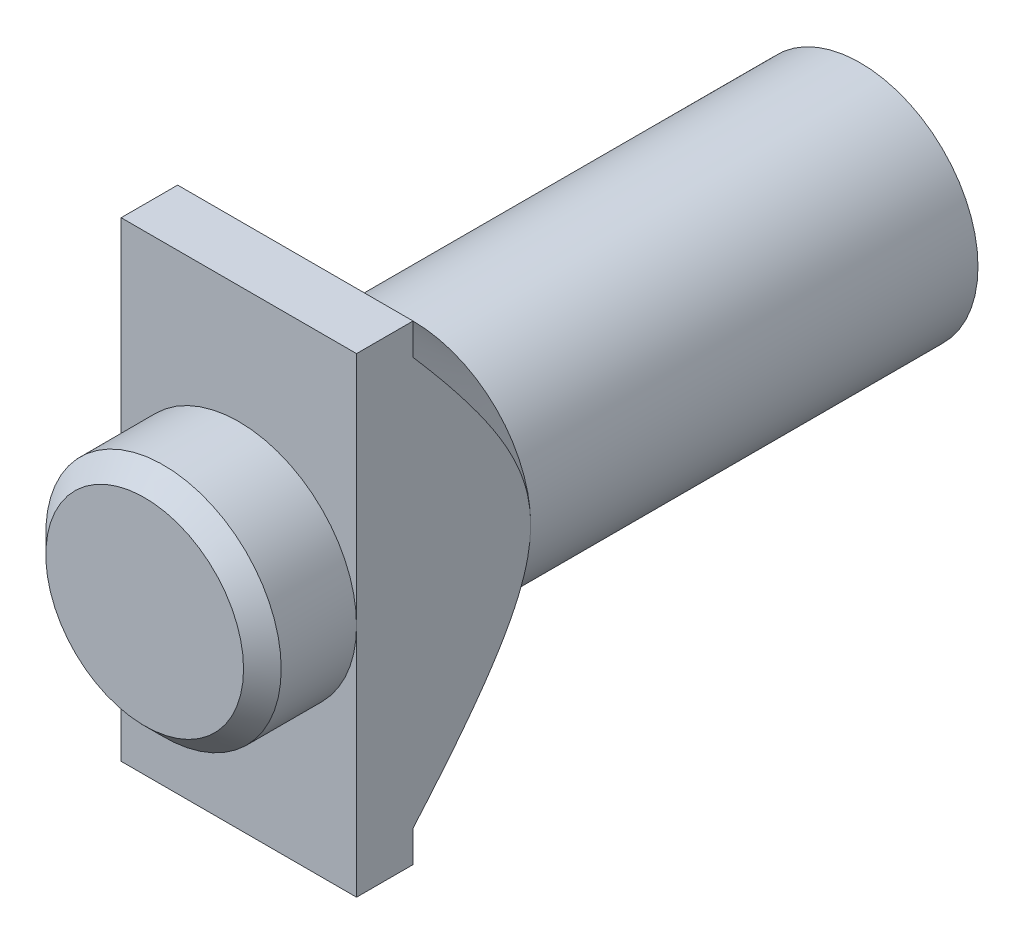
ISO-10303-21;
HEADER;
FILE_DESCRIPTION(('STEP AP214'),'2;1');
FILE_NAME('part.step','',(''),(''),'','','');
FILE_SCHEMA(('AUTOMOTIVE_DESIGN { 1 0 10303 214 1 1 1 1 }'));
ENDSEC;
DATA;
#1=APPLICATION_CONTEXT('core data for automotive mechanical design processes');
#2=APPLICATION_PROTOCOL_DEFINITION('international standard','automotive_design',2000,#1);
#3=PRODUCT_CONTEXT('',#1,'mechanical');
#4=PRODUCT('Part','Part','',(#3));
#5=PRODUCT_RELATED_PRODUCT_CATEGORY('part','',(#4));
#6=PRODUCT_DEFINITION_FORMATION('','',#4);
#7=PRODUCT_DEFINITION_CONTEXT('part definition',#1,'design');
#8=PRODUCT_DEFINITION('design','',#6,#7);
#9=PRODUCT_DEFINITION_SHAPE('','',#8);
#10=(LENGTH_UNIT() NAMED_UNIT(*) SI_UNIT(.MILLI.,.METRE.));
#11=(NAMED_UNIT(*) PLANE_ANGLE_UNIT() SI_UNIT($,.RADIAN.));
#12=(NAMED_UNIT(*) SI_UNIT($,.STERADIAN.) SOLID_ANGLE_UNIT());
#13=UNCERTAINTY_MEASURE_WITH_UNIT(LENGTH_MEASURE(1.E-05),#10,'distance_accuracy_value','');
#14=(GEOMETRIC_REPRESENTATION_CONTEXT(3) GLOBAL_UNCERTAINTY_ASSIGNED_CONTEXT((#13)) GLOBAL_UNIT_ASSIGNED_CONTEXT((#10,
#11,#12)) REPRESENTATION_CONTEXT('',''));
#15=CARTESIAN_POINT('',(0.,0.,0.));
#16=DIRECTION('',(0.,0.,1.));
#17=DIRECTION('',(1.,0.,0.));
#18=AXIS2_PLACEMENT_3D('',#15,#16,#17);
#19=CARTESIAN_POINT('',(0.,0.,33.));
#20=DIRECTION('',(0.,0.,-1.));
#21=DIRECTION('',(-1.,0.,0.));
#22=AXIS2_PLACEMENT_3D('',#19,#20,#21);
#23=PLANE('',#22);
#24=CARTESIAN_POINT('',(0.,0.,33.));
#25=DIRECTION('',(0.,0.,1.));
#26=DIRECTION('',(1.,0.,0.));
#27=AXIS2_PLACEMENT_3D('',#24,#25,#26);
#28=CIRCLE('',#27,6.25);
#29=CARTESIAN_POINT('',(6.25,0.,33.));
#30=VERTEX_POINT('',#29);
#31=CARTESIAN_POINT('',(-6.25,0.,33.));
#32=VERTEX_POINT('',#31);
#33=EDGE_CURVE('E136',#30,#32,#28,.T.);
#34=ORIENTED_EDGE('',*,*,#33,.F.);
#35=DIRECTION('',(0.,1.,0.));
#36=VECTOR('',#35,1.);
#37=CARTESIAN_POINT('',(6.25,12.5,33.));
#38=LINE('',#37,#36);
#39=CARTESIAN_POINT('',(6.25,12.5,33.));
#40=VERTEX_POINT('',#39);
#41=EDGE_CURVE('E124',#30,#40,#38,.T.);
#42=ORIENTED_EDGE('',*,*,#41,.T.);
#43=DIRECTION('',(-1.,0.,0.));
#44=VECTOR('',#43,1.);
#45=CARTESIAN_POINT('',(6.25,12.5,33.));
#46=LINE('',#45,#44);
#47=CARTESIAN_POINT('',(-6.25,12.5,33.));
#48=VERTEX_POINT('',#47);
#49=EDGE_CURVE('E123',#40,#48,#46,.T.);
#50=ORIENTED_EDGE('',*,*,#49,.T.);
#51=DIRECTION('',(0.,-1.,0.));
#52=VECTOR('',#51,1.);
#53=CARTESIAN_POINT('',(-6.25,12.5,33.));
#54=LINE('',#53,#52);
#55=EDGE_CURVE('E138',#48,#32,#54,.T.);
#56=ORIENTED_EDGE('',*,*,#55,.T.);
#57=EDGE_LOOP('',(#34,#42,#50,#56));
#58=FACE_BOUND('',#57,.T.);
#59=ADVANCED_FACE('F34',(#58),#23,.F.);
#60=CARTESIAN_POINT('',(0.,0.,17.5));
#61=DIRECTION('',(0.,0.,1.));
#62=DIRECTION('',(1.,0.,0.));
#63=AXIS2_PLACEMENT_3D('',#60,#61,#62);
#64=CONICAL_SURFACE('',#63,0.,0.785398163397448);
#65=CARTESIAN_POINT('',(-6.25,-20.3779042036245,38.8148183133729));
#66=CARTESIAN_POINT('',(-6.25,-19.956191433902,38.4116642934186));
#67=CARTESIAN_POINT('',(-6.25,-19.5339612836575,38.009049625188));
#68=CARTESIAN_POINT('',(-6.25,-18.6882032119992,37.2051749566873));
#69=CARTESIAN_POINT('',(-6.25,-18.2646752737749,36.8039149741074));
#70=CARTESIAN_POINT('',(-6.25,-17.4158750988892,36.0028526070599));
#71=CARTESIAN_POINT('',(-6.25,-16.9906021517175,35.6030509749646));
#72=CARTESIAN_POINT('',(-6.25,-16.1381531535375,34.8054851155684));
#73=CARTESIAN_POINT('',(-6.25,-15.7109771130856,34.4077208769922));
#74=CARTESIAN_POINT('',(-6.25,-14.8583547265776,33.6185421117259));
#75=CARTESIAN_POINT('',(-6.25,-14.4329309299977,33.2271032435303));
#76=CARTESIAN_POINT('',(-6.25,-13.5791568381813,32.4474311641986));
#77=CARTESIAN_POINT('',(-6.25,-13.1508065614255,32.059197932853));
#78=CARTESIAN_POINT('',(-6.25,-12.2904238158171,31.2869870505959));
#79=CARTESIAN_POINT('',(-6.25,-11.8583920366553,30.9030086323027));
#80=CARTESIAN_POINT('',(-6.25,-10.989419200207,30.1406562079682));
#81=CARTESIAN_POINT('',(-6.25,-10.5524783025272,29.7622820206425));
#82=CARTESIAN_POINT('',(-6.25,-9.80424107848541,29.1258131888779));
#83=CARTESIAN_POINT('',(-6.25,-9.49463466915096,28.8657341904933));
#84=CARTESIAN_POINT('',(-6.25,-8.87134141818233,28.3504553480673));
#85=CARTESIAN_POINT('',(-6.25,-8.55765431189853,28.0952558231571));
#86=CARTESIAN_POINT('',(-6.25,-7.92315769066826,27.5896943243694));
#87=CARTESIAN_POINT('',(-6.25,-7.60231577287842,27.3393729100103));
#88=CARTESIAN_POINT('',(-6.25,-6.95399389299023,26.8475015389668));
#89=CARTESIAN_POINT('',(-6.25,-6.62651488164475,26.6059503396093));
#90=CARTESIAN_POINT('',(-6.25,-6.12693213321716,26.2514528224235));
#91=CARTESIAN_POINT('',(-6.25,-5.95805177942696,26.1339635220813));
#92=CARTESIAN_POINT('',(-6.25,-5.61774717271675,25.902735729327));
#93=CARTESIAN_POINT('',(-6.25,-5.44632304676741,25.7889970506122));
#94=CARTESIAN_POINT('',(-6.25,-5.10039890316192,25.5659209828393));
#95=CARTESIAN_POINT('',(-6.25,-4.92589618113803,25.4565877720605));
#96=CARTESIAN_POINT('',(-6.25,-4.57356822916663,25.2434066254721));
#97=CARTESIAN_POINT('',(-6.25,-4.39574306799838,25.1395585762817));
#98=CARTESIAN_POINT('',(-6.25,-4.03752543568063,24.9392350286463));
#99=CARTESIAN_POINT('',(-6.25,-3.85715846158145,24.8427144183373));
#100=CARTESIAN_POINT('',(-6.25,-3.49232520144321,24.6577997142373));
#101=CARTESIAN_POINT('',(-6.25,-3.30785843761678,24.5694065738494));
#102=CARTESIAN_POINT('',(-6.25,-2.74828086539234,24.3194060826822));
#103=CARTESIAN_POINT('',(-6.25,-2.36614798790808,24.1724864812357));
#104=CARTESIAN_POINT('',(-6.25,-1.77377304479165,23.9939927652976));
#105=CARTESIAN_POINT('',(-6.25,-1.56994257847604,23.9410204441361));
#106=CARTESIAN_POINT('',(-6.25,-1.1583459974185,23.8532579073313));
#107=CARTESIAN_POINT('',(-6.25,-0.95058050667565,23.818464833507));
#108=CARTESIAN_POINT('',(-6.25,-0.533567581615178,23.7693345892413));
#109=CARTESIAN_POINT('',(-6.25,-0.324331248563969,23.7549047237935));
#110=CARTESIAN_POINT('',(-6.25,0.094539769901834,23.7472072627269));
#111=CARTESIAN_POINT('',(-6.25,0.304174453803751,23.7539395869078));
#112=CARTESIAN_POINT('',(-6.25,0.721043041717737,23.7880327727173));
#113=CARTESIAN_POINT('',(-6.25,0.928282509871575,23.8153269986723));
#114=CARTESIAN_POINT('',(-6.25,1.33937761500408,23.888699230379));
#115=CARTESIAN_POINT('',(-6.25,1.54323277334587,23.9347798698997));
#116=CARTESIAN_POINT('',(-6.25,1.94771992610081,24.0435385446616));
#117=CARTESIAN_POINT('',(-6.25,2.14832505757752,24.1063150287326));
#118=CARTESIAN_POINT('',(-6.25,2.54463187644215,24.2456078573584));
#119=CARTESIAN_POINT('',(-6.25,2.74033373350042,24.3221237257324));
#120=CARTESIAN_POINT('',(-6.25,3.20065245694356,24.5177034249675));
#121=CARTESIAN_POINT('',(-6.25,3.46309130630112,24.6418657274016));
#122=CARTESIAN_POINT('',(-6.25,3.97983098835652,24.9062301015164));
#123=CARTESIAN_POINT('',(-6.25,4.23412647018221,25.0464424534619));
#124=CARTESIAN_POINT('',(-6.25,4.73623797846259,25.3391819482185));
#125=CARTESIAN_POINT('',(-6.25,4.98403813791151,25.4917360908023));
#126=CARTESIAN_POINT('',(-6.25,5.47368749083448,25.8059332305952));
#127=CARTESIAN_POINT('',(-6.25,5.71553799493993,25.9675741998486));
#128=CARTESIAN_POINT('',(-6.25,6.19745467687006,26.3000078500455));
#129=CARTESIAN_POINT('',(-6.25,6.43745775048509,26.4708915899795));
#130=CARTESIAN_POINT('',(-6.25,6.91335330544523,26.8182897980414));
#131=CARTESIAN_POINT('',(-6.25,7.14924560963853,26.9948045079101));
#132=CARTESIAN_POINT('',(-6.25,7.61727805416882,27.3520355711754));
#133=CARTESIAN_POINT('',(-6.25,7.8494231388434,27.5327454615836));
#134=CARTESIAN_POINT('',(-6.25,8.19550409111854,27.8064942542065));
#135=CARTESIAN_POINT('',(-6.25,8.31050668431183,27.8981898617577));
#136=CARTESIAN_POINT('',(-6.25,8.53985964049112,28.082392715467));
#137=CARTESIAN_POINT('',(-6.25,8.65421000514089,28.1748999595533));
#138=CARTESIAN_POINT('',(-6.25,9.04920975406273,28.4965472759183));
#139=CARTESIAN_POINT('',(-6.25,9.32835133491879,28.7275406828485));
#140=CARTESIAN_POINT('',(-6.25,9.88369749073528,29.1930356641751));
#141=CARTESIAN_POINT('',(-6.25,10.1599019892755,29.4275373294732));
#142=CARTESIAN_POINT('',(-6.25,10.709910737363,29.8993836274437));
#143=CARTESIAN_POINT('',(-6.25,10.9837147785209,30.1367285027913));
#144=CARTESIAN_POINT('',(-6.25,11.5293044836752,30.6137285086972));
#145=CARTESIAN_POINT('',(-6.25,11.8010901301241,30.853383659299));
#146=CARTESIAN_POINT('',(-6.25,12.6140800724638,31.5753367494932));
#147=CARTESIAN_POINT('',(-6.25,13.1527552357815,32.0604823590886));
#148=CARTESIAN_POINT('',(-6.25,14.2252483019851,33.0361134236179));
#149=CARTESIAN_POINT('',(-6.25,14.7590661265787,33.5265989643439));
#150=CARTESIAN_POINT('',(-6.25,15.5575076805858,34.2656928953683));
#151=CARTESIAN_POINT('',(-6.25,15.8234972101369,34.5128281834132));
#152=CARTESIAN_POINT('',(-6.25,16.3546722789463,35.0079567391255));
#153=CARTESIAN_POINT('',(-6.25,16.6198578250411,35.2559499994588));
#154=CARTESIAN_POINT('',(-6.25,17.4143735193573,36.0010544618421));
#155=CARTESIAN_POINT('',(-6.25,17.9426553794712,36.4992835351428));
#156=CARTESIAN_POINT('',(-6.25,18.9969371386686,37.497940665872));
#157=CARTESIAN_POINT('',(-6.25,19.5229374660875,37.9983682715837));
#158=CARTESIAN_POINT('',(-6.25,20.5732023165024,39.0010415512331));
#159=CARTESIAN_POINT('',(-6.25,21.09746683838,39.5032872263419));
#160=CARTESIAN_POINT('',(-6.25,22.5515859782985,40.9002010455956));
#161=CARTESIAN_POINT('',(-6.25,23.4799367020753,41.796434344247));
#162=CARTESIAN_POINT('',(-6.25,25.3335870803069,43.5921566665612));
#163=CARTESIAN_POINT('',(-6.25,26.2588865508424,44.4916458798643));
#164=CARTESIAN_POINT('',(-6.25,28.1047594601269,46.290573585135));
#165=CARTESIAN_POINT('',(-6.25,29.025338925008,47.1900058965324));
#166=CARTESIAN_POINT('',(-6.25,30.8646926511388,48.9905946398053));
#167=CARTESIAN_POINT('',(-6.25,31.7834670264829,49.8917509551076));
#168=CARTESIAN_POINT('',(-6.25000000000001,32.7016290359367,50.7935285243847));
#169=B_SPLINE_CURVE_WITH_KNOTS('',3,(#65,#66,#67,#68,#69,#70,#71,#72,#73,#74,#75,#76,#77,#78,
#79,#80,#81,#82,#83,#84,#85,#86,#87,#88,#89,#90,#91,#92,#93,#94,#95,#96,#97,#98,#99,#100,#101,
#102,#103,#104,#105,#106,#107,#108,#109,#110,#111,#112,#113,#114,#115,#116,#117,#118,#119,#120,
#121,#122,#123,#124,#125,#126,#127,#128,#129,#130,#131,#132,#133,#134,#135,#136,#137,#138,#139,
#140,#141,#142,#143,#144,#145,#146,#147,#148,#149,#150,#151,#152,#153,#154,#155,#156,#157,#158,
#159,#160,#161,#162,#163,#164,#165,#166,#167,#168),.UNSPECIFIED.,.F.,.F.,(4,2,2,2,2,2,2,2,2,2,2,
2,2,2,2,2,2,2,2,2,2,2,2,2,2,2,2,2,2,2,2,2,2,2,2,2,2,2,2,2,2,2,2,2,2,2,2,2,2,2,2,4),(0.,
1.75025095945234,3.50052468690949,5.25160063652178,7.00266688486185,8.73698092366364,
10.4712840203936,12.2052690599496,13.9391978858885,15.1522047133163,16.3652906052413,
17.5860120194707,18.8065597862946,19.4237065743735,20.0408226609192,20.6585108869872,
21.2761863401593,21.8896843380209,22.5032542114608,23.7274722883708,24.3586139105743,
24.9896562734293,25.6178167099408,26.2459747658548,26.8721058384976,27.498324722048,
28.1283213476558,28.7582961429965,29.6284981900893,30.4992607650149,31.3719826539967,
32.244510540299,33.1282766339939,34.0120807194876,34.8946033859673,35.3358522351004,
35.7770999581486,36.8640275609451,37.9509833757559,39.0380326355476,40.1250913348812,
42.2998512502892,44.4746461574162,45.5638811708668,46.6531068961794,48.8315883934236,
51.0096414744794,53.187695958611,57.0588102887139,60.9301538408477,64.7912397125438,
68.6520731346324),.UNSPECIFIED.);
#170=CARTESIAN_POINT('',(-6.25,10.8253175473055,30.));
#171=VERTEX_POINT('',#170);
#172=CARTESIAN_POINT('',(-6.25,0.,23.75));
#173=VERTEX_POINT('',#172);
#174=EDGE_CURVE('E57',#171,#173,#169,.F.);
#175=ORIENTED_EDGE('',*,*,#174,.F.);
#176=CARTESIAN_POINT('',(0.,0.,30.));
#177=DIRECTION('',(0.,0.,-1.));
#178=DIRECTION('',(-1.,0.,0.));
#179=AXIS2_PLACEMENT_3D('',#176,#177,#178);
#180=CIRCLE('',#179,12.5);
#181=CARTESIAN_POINT('',(0.,12.5,30.));
#182=VERTEX_POINT('',#181);
#183=EDGE_CURVE('E362',#171,#182,#180,.T.);
#184=ORIENTED_EDGE('',*,*,#183,.T.);
#185=CARTESIAN_POINT('',(6.25,10.8253175473055,30.));
#186=VERTEX_POINT('',#185);
#187=EDGE_CURVE('E368',#182,#186,#180,.T.);
#188=ORIENTED_EDGE('',*,*,#187,.T.);
#189=CARTESIAN_POINT('',(6.25,-20.3779042036245,38.8148183133729));
#190=CARTESIAN_POINT('',(6.25,-19.956191433902,38.4116642934186));
#191=CARTESIAN_POINT('',(6.25,-19.5339612836575,38.009049625188));
#192=CARTESIAN_POINT('',(6.25,-18.6882032119992,37.2051749566873));
#193=CARTESIAN_POINT('',(6.25,-18.2646752737749,36.8039149741074));
#194=CARTESIAN_POINT('',(6.25,-17.4158750988892,36.0028526070599));
#195=CARTESIAN_POINT('',(6.25,-16.9906021517175,35.6030509749646));
#196=CARTESIAN_POINT('',(6.25,-16.1381531535375,34.8054851155684));
#197=CARTESIAN_POINT('',(6.25,-15.7109771130856,34.4077208769922));
#198=CARTESIAN_POINT('',(6.25,-14.8583547265776,33.6185421117259));
#199=CARTESIAN_POINT('',(6.25,-14.4329309299977,33.2271032435303));
#200=CARTESIAN_POINT('',(6.25,-13.5791568381813,32.4474311641986));
#201=CARTESIAN_POINT('',(6.25,-13.1508065614255,32.059197932853));
#202=CARTESIAN_POINT('',(6.25,-12.2904238158171,31.2869870505959));
#203=CARTESIAN_POINT('',(6.25,-11.8583920366553,30.9030086323027));
#204=CARTESIAN_POINT('',(6.25,-10.989419200207,30.1406562079682));
#205=CARTESIAN_POINT('',(6.25,-10.5524783025272,29.7622820206425));
#206=CARTESIAN_POINT('',(6.25,-9.80424107848541,29.1258131888779));
#207=CARTESIAN_POINT('',(6.25,-9.49463466915096,28.8657341904933));
#208=CARTESIAN_POINT('',(6.25,-8.87134141818233,28.3504553480673));
#209=CARTESIAN_POINT('',(6.25,-8.55765431189853,28.0952558231571));
#210=CARTESIAN_POINT('',(6.25,-7.92315769066825,27.5896943243694));
#211=CARTESIAN_POINT('',(6.25,-7.60231577287841,27.3393729100103));
#212=CARTESIAN_POINT('',(6.25,-6.95399389299022,26.8475015389668));
#213=CARTESIAN_POINT('',(6.25,-6.62651488164475,26.6059503396093));
#214=CARTESIAN_POINT('',(6.25,-6.12693213321716,26.2514528224235));
#215=CARTESIAN_POINT('',(6.25,-5.95805177942696,26.1339635220813));
#216=CARTESIAN_POINT('',(6.25,-5.61774717271675,25.902735729327));
#217=CARTESIAN_POINT('',(6.25,-5.44632304676741,25.7889970506122));
#218=CARTESIAN_POINT('',(6.25,-5.10039890316192,25.5659209828393));
#219=CARTESIAN_POINT('',(6.25,-4.92589618113802,25.4565877720605));
#220=CARTESIAN_POINT('',(6.25,-4.57356822916662,25.2434066254721));
#221=CARTESIAN_POINT('',(6.25,-4.39574306799837,25.1395585762817));
#222=CARTESIAN_POINT('',(6.25,-4.03752543568063,24.9392350286463));
#223=CARTESIAN_POINT('',(6.25,-3.85715846158144,24.8427144183373));
#224=CARTESIAN_POINT('',(6.25,-3.4923252014432,24.6577997142373));
#225=CARTESIAN_POINT('',(6.25,-3.30785843761678,24.5694065738494));
#226=CARTESIAN_POINT('',(6.25,-2.74828086539234,24.3194060826822));
#227=CARTESIAN_POINT('',(6.25,-2.36614798790807,24.1724864812357));
#228=CARTESIAN_POINT('',(6.25,-1.77377304479165,23.9939927652976));
#229=CARTESIAN_POINT('',(6.25,-1.56994257847604,23.9410204441361));
#230=CARTESIAN_POINT('',(6.25,-1.1583459974185,23.8532579073313));
#231=CARTESIAN_POINT('',(6.25,-0.950580506675646,23.818464833507));
#232=CARTESIAN_POINT('',(6.25,-0.533567581615174,23.7693345892413));
#233=CARTESIAN_POINT('',(6.25,-0.324331248563967,23.7549047237935));
#234=CARTESIAN_POINT('',(6.25,0.0945397699018367,23.7472072627269));
#235=CARTESIAN_POINT('',(6.25,0.304174453803755,23.7539395869078));
#236=CARTESIAN_POINT('',(6.25,0.721043041717742,23.7880327727173));
#237=CARTESIAN_POINT('',(6.25,0.928282509871579,23.8153269986723));
#238=CARTESIAN_POINT('',(6.25,1.33937761500409,23.888699230379));
#239=CARTESIAN_POINT('',(6.25,1.54323277334588,23.9347798698997));
#240=CARTESIAN_POINT('',(6.25,1.94771992610081,24.0435385446616));
#241=CARTESIAN_POINT('',(6.25,2.14832505757752,24.1063150287326));
#242=CARTESIAN_POINT('',(6.25,2.54463187644216,24.2456078573584));
#243=CARTESIAN_POINT('',(6.25,2.74033373350043,24.3221237257324));
#244=CARTESIAN_POINT('',(6.25,3.20065245694357,24.5177034249675));
#245=CARTESIAN_POINT('',(6.25,3.46309130630113,24.6418657274016));
#246=CARTESIAN_POINT('',(6.25,3.97983098835653,24.9062301015164));
#247=CARTESIAN_POINT('',(6.25,4.23412647018222,25.0464424534619));
#248=CARTESIAN_POINT('',(6.25,4.73623797846261,25.3391819482185));
#249=CARTESIAN_POINT('',(6.25,4.98403813791153,25.4917360908024));
#250=CARTESIAN_POINT('',(6.25,5.4736874908345,25.8059332305952));
#251=CARTESIAN_POINT('',(6.25,5.71553799493995,25.9675741998486));
#252=CARTESIAN_POINT('',(6.25,6.19745467687008,26.3000078500455));
#253=CARTESIAN_POINT('',(6.25,6.43745775048511,26.4708915899796));
#254=CARTESIAN_POINT('',(6.25,6.91335330544525,26.8182897980414));
#255=CARTESIAN_POINT('',(6.25,7.14924560963855,26.9948045079101));
#256=CARTESIAN_POINT('',(6.25,7.61727805416883,27.3520355711754));
#257=CARTESIAN_POINT('',(6.25,7.84942313884342,27.5327454615836));
#258=CARTESIAN_POINT('',(6.25,8.19550409111855,27.8064942542065));
#259=CARTESIAN_POINT('',(6.25,8.31050668431184,27.8981898617577));
#260=CARTESIAN_POINT('',(6.25,8.53985964049114,28.082392715467));
#261=CARTESIAN_POINT('',(6.25,8.65421000514091,28.1748999595533));
#262=CARTESIAN_POINT('',(6.25,9.04920975406275,28.4965472759183));
#263=CARTESIAN_POINT('',(6.25,9.32835133491881,28.7275406828485));
#264=CARTESIAN_POINT('',(6.25,9.8836974907353,29.1930356641752));
#265=CARTESIAN_POINT('',(6.25,10.1599019892755,29.4275373294732));
#266=CARTESIAN_POINT('',(6.25,10.709910737363,29.8993836274437));
#267=CARTESIAN_POINT('',(6.25,10.9837147785209,30.1367285027913));
#268=CARTESIAN_POINT('',(6.25,11.5293044836752,30.6137285086972));
#269=CARTESIAN_POINT('',(6.25,11.8010901301241,30.853383659299));
#270=CARTESIAN_POINT('',(6.25,12.6140800724639,31.5753367494932));
#271=CARTESIAN_POINT('',(6.25,13.1527552357815,32.0604823590887));
#272=CARTESIAN_POINT('',(6.25,14.2252483019851,33.0361134236179));
#273=CARTESIAN_POINT('',(6.25,14.7590661265787,33.5265989643439));
#274=CARTESIAN_POINT('',(6.25,15.5575076805859,34.2656928953683));
#275=CARTESIAN_POINT('',(6.25,15.8234972101369,34.5128281834132));
#276=CARTESIAN_POINT('',(6.25,16.3546722789463,35.0079567391256));
#277=CARTESIAN_POINT('',(6.25,16.6198578250411,35.2559499994589));
#278=CARTESIAN_POINT('',(6.25,17.4143735193574,36.0010544618421));
#279=CARTESIAN_POINT('',(6.25,17.9426553794712,36.4992835351428));
#280=CARTESIAN_POINT('',(6.25,18.9969371386686,37.4979406658721));
#281=CARTESIAN_POINT('',(6.25,19.5229374660876,37.9983682715837));
#282=CARTESIAN_POINT('',(6.25,20.5732023165025,39.0010415512332));
#283=CARTESIAN_POINT('',(6.25,21.0974668383801,39.5032872263419));
#284=CARTESIAN_POINT('',(6.25,22.5515859782986,40.9002010455956));
#285=CARTESIAN_POINT('',(6.25,23.4799367020754,41.796434344247));
#286=CARTESIAN_POINT('',(6.25,25.333587080307,43.5921566665613));
#287=CARTESIAN_POINT('',(6.25,26.2588865508425,44.4916458798644));
#288=CARTESIAN_POINT('',(6.25,28.104759460127,46.2905735851351));
#289=CARTESIAN_POINT('',(6.25,29.025338925008,47.1900058965324));
#290=CARTESIAN_POINT('',(6.25,30.8646926511388,48.9905946398053));
#291=CARTESIAN_POINT('',(6.25,31.7834670264829,49.8917509551076));
#292=CARTESIAN_POINT('',(6.25,32.7016290359367,50.7935285243847));
#293=B_SPLINE_CURVE_WITH_KNOTS('',3,(#189,#190,#191,#192,#193,#194,#195,#196,#197,#198,#199,
#200,#201,#202,#203,#204,#205,#206,#207,#208,#209,#210,#211,#212,#213,#214,#215,#216,#217,#218,
#219,#220,#221,#222,#223,#224,#225,#226,#227,#228,#229,#230,#231,#232,#233,#234,#235,#236,#237,
#238,#239,#240,#241,#242,#243,#244,#245,#246,#247,#248,#249,#250,#251,#252,#253,#254,#255,#256,
#257,#258,#259,#260,#261,#262,#263,#264,#265,#266,#267,#268,#269,#270,#271,#272,#273,#274,#275,
#276,#277,#278,#279,#280,#281,#282,#283,#284,#285,#286,#287,#288,#289,#290,#291,#292),
.UNSPECIFIED.,.F.,.F.,(4,2,2,2,2,2,2,2,2,2,2,2,2,2,2,2,2,2,2,2,2,2,2,2,2,2,2,2,2,2,2,2,2,2,2,2,
2,2,2,2,2,2,2,2,2,2,2,2,2,2,2,4),(0.,1.75025095945234,3.50052468690949,5.25160063652179,
7.00266688486184,8.73698092366363,10.4712840203936,12.2052690599496,13.9391978858885,
15.1522047133163,16.3652906052413,17.5860120194707,18.8065597862946,19.4237065743735,
20.0408226609192,20.6585108869873,21.2761863401593,21.8896843380209,22.5032542114609,
23.7274722883708,24.3586139105743,24.9896562734293,25.6178167099408,26.2459747658548,
26.8721058384976,27.4983247220481,28.1283213476558,28.7582961429965,29.6284981900893,
30.4992607650149,31.3719826539967,32.2445105402991,33.1282766339939,34.0120807194877,
34.8946033859673,35.3358522351004,35.7770999581486,36.8640275609451,37.9509833757559,
39.0380326355476,40.1250913348812,42.2998512502892,44.4746461574163,45.5638811708668,
46.6531068961794,48.8315883934236,51.0096414744795,53.1876959586111,57.0588102887139,
60.9301538408478,64.7912397125439,68.6520731346325),.UNSPECIFIED.);
#294=CARTESIAN_POINT('',(6.25,0.,23.75));
#295=VERTEX_POINT('',#294);
#296=EDGE_CURVE('E155',#295,#186,#293,.T.);
#297=ORIENTED_EDGE('',*,*,#296,.F.);
#298=CARTESIAN_POINT('',(0.,0.,23.75));
#299=DIRECTION('',(0.,0.,1.));
#300=DIRECTION('',(1.,0.,0.));
#301=AXIS2_PLACEMENT_3D('',#298,#299,#300);
#302=CIRCLE('',#301,6.25);
#303=EDGE_CURVE('E367',#173,#295,#302,.F.);
#304=ORIENTED_EDGE('',*,*,#303,.F.);
#305=EDGE_LOOP('',(#175,#184,#188,#297,#304));
#306=FACE_BOUND('',#305,.T.);
#307=ADVANCED_FACE('F169',(#306),#64,.T.);
#308=CARTESIAN_POINT('',(0.,0.,30.));
#309=DIRECTION('',(0.,0.,-1.));
#310=DIRECTION('',(-1.,0.,0.));
#311=AXIS2_PLACEMENT_3D('',#308,#309,#310);
#312=CYLINDRICAL_SURFACE('',#311,6.25);
#313=CARTESIAN_POINT('',(0.,0.,0.));
#314=DIRECTION('',(0.,0.,1.));
#315=DIRECTION('',(1.,0.,0.));
#316=AXIS2_PLACEMENT_3D('',#313,#314,#315);
#317=CIRCLE('',#316,6.25);
#318=CARTESIAN_POINT('',(6.25,0.,0.));
#319=VERTEX_POINT('',#318);
#320=EDGE_CURVE('E408',#319,#319,#317,.T.);
#321=ORIENTED_EDGE('',*,*,#320,.T.);
#322=EDGE_LOOP('',(#321));
#323=FACE_BOUND('',#322,.T.);
#324=EDGE_CURVE('E377',#295,#173,#302,.F.);
#325=ORIENTED_EDGE('',*,*,#324,.T.);
#326=ORIENTED_EDGE('',*,*,#303,.T.);
#327=EDGE_LOOP('',(#325,#326));
#328=FACE_BOUND('',#327,.T.);
#329=ADVANCED_FACE('F207',(#323,#328),#312,.T.);
#330=CARTESIAN_POINT('',(0.,0.,0.));
#331=DIRECTION('',(0.,0.,1.));
#332=DIRECTION('',(1.,0.,0.));
#333=AXIS2_PLACEMENT_3D('',#330,#331,#332);
#334=PLANE('',#333);
#335=DIRECTION('',(1.,0.,0.));
#336=VECTOR('',#335,1.);
#337=CARTESIAN_POINT('',(1.61632298752446,2.1,0.));
#338=LINE('',#337,#336);
#339=CARTESIAN_POINT('',(-1.61632298752446,2.1,0.));
#340=VERTEX_POINT('',#339);
#341=CARTESIAN_POINT('',(1.61632298752446,2.1,0.));
#342=VERTEX_POINT('',#341);
#343=EDGE_CURVE('E399',#340,#342,#338,.T.);
#344=ORIENTED_EDGE('',*,*,#343,.F.);
#345=CARTESIAN_POINT('',(0.,0.,0.));
#346=DIRECTION('',(0.,0.,-1.));
#347=DIRECTION('',(-1.,0.,0.));
#348=AXIS2_PLACEMENT_3D('',#345,#346,#347);
#349=CIRCLE('',#348,2.65);
#350=EDGE_CURVE('E394',#342,#340,#349,.T.);
#351=ORIENTED_EDGE('',*,*,#350,.F.);
#352=EDGE_LOOP('',(#344,#351));
#353=FACE_BOUND('',#352,.T.);
#354=ORIENTED_EDGE('',*,*,#320,.F.);
#355=EDGE_LOOP('',(#354));
#356=FACE_BOUND('',#355,.T.);
#357=ADVANCED_FACE('F204',(#353,#356),#334,.F.);
#358=CARTESIAN_POINT('',(0.,0.,15.));
#359=DIRECTION('',(0.,0.,-1.));
#360=DIRECTION('',(-1.,0.,0.));
#361=AXIS2_PLACEMENT_3D('',#358,#359,#360);
#362=CYLINDRICAL_SURFACE('',#361,2.65);
#363=ORIENTED_EDGE('',*,*,#350,.T.);
#364=DIRECTION('',(0.,0.,-1.));
#365=VECTOR('',#364,1.);
#366=CARTESIAN_POINT('',(-1.61632298752446,2.1,15.));
#367=LINE('',#366,#365);
#368=CARTESIAN_POINT('',(-1.61632298752446,2.1,15.));
#369=VERTEX_POINT('',#368);
#370=EDGE_CURVE('E402',#369,#340,#367,.T.);
#371=ORIENTED_EDGE('',*,*,#370,.F.);
#372=CARTESIAN_POINT('',(0.,0.,15.));
#373=DIRECTION('',(0.,0.,-1.));
#374=DIRECTION('',(-1.,0.,0.));
#375=AXIS2_PLACEMENT_3D('',#372,#373,#374);
#376=CIRCLE('',#375,2.65);
#377=CARTESIAN_POINT('',(1.61632298752446,2.1,15.));
#378=VERTEX_POINT('',#377);
#379=EDGE_CURVE('E395',#378,#369,#376,.T.);
#380=ORIENTED_EDGE('',*,*,#379,.F.);
#381=DIRECTION('',(0.,0.,-1.));
#382=VECTOR('',#381,1.);
#383=CARTESIAN_POINT('',(1.61632298752446,2.1,15.));
#384=LINE('',#383,#382);
#385=EDGE_CURVE('E406',#378,#342,#384,.T.);
#386=ORIENTED_EDGE('',*,*,#385,.T.);
#387=EDGE_LOOP('',(#363,#371,#380,#386));
#388=FACE_BOUND('',#387,.T.);
#389=ADVANCED_FACE('F200',(#388),#362,.F.);
#390=CARTESIAN_POINT('',(1.61632298752446,2.1,15.));
#391=DIRECTION('',(0.,1.,0.));
#392=DIRECTION('',(0.,0.,1.));
#393=AXIS2_PLACEMENT_3D('',#390,#391,#392);
#394=PLANE('',#393);
#395=ORIENTED_EDGE('',*,*,#343,.T.);
#396=ORIENTED_EDGE('',*,*,#385,.F.);
#397=DIRECTION('',(1.,0.,0.));
#398=VECTOR('',#397,1.);
#399=CARTESIAN_POINT('',(1.61632298752446,2.1,15.));
#400=LINE('',#399,#398);
#401=EDGE_CURVE('E398',#369,#378,#400,.T.);
#402=ORIENTED_EDGE('',*,*,#401,.F.);
#403=ORIENTED_EDGE('',*,*,#370,.T.);
#404=EDGE_LOOP('',(#395,#396,#402,#403));
#405=FACE_BOUND('',#404,.T.);
#406=ADVANCED_FACE('F196',(#405),#394,.F.);
#407=CARTESIAN_POINT('',(0.,0.,15.));
#408=DIRECTION('',(0.,0.,-1.));
#409=DIRECTION('',(-1.,0.,0.));
#410=AXIS2_PLACEMENT_3D('',#407,#408,#409);
#411=PLANE('',#410);
#412=ORIENTED_EDGE('',*,*,#379,.T.);
#413=ORIENTED_EDGE('',*,*,#401,.T.);
#414=EDGE_LOOP('',(#412,#413));
#415=FACE_BOUND('',#414,.T.);
#416=ADVANCED_FACE('F167',(#415),#411,.T.);
#417=CARTESIAN_POINT('',(-6.25,-10.8253175473055,30.));
#418=VERTEX_POINT('',#417);
#419=EDGE_CURVE('E154',#173,#418,#169,.F.);
#420=ORIENTED_EDGE('',*,*,#419,.F.);
#421=ORIENTED_EDGE('',*,*,#324,.F.);
#422=CARTESIAN_POINT('',(6.25,-10.8253175473055,30.));
#423=VERTEX_POINT('',#422);
#424=EDGE_CURVE('E420',#423,#295,#293,.T.);
#425=ORIENTED_EDGE('',*,*,#424,.F.);
#426=CARTESIAN_POINT('',(0.,0.,30.));
#427=DIRECTION('',(0.,0.,-1.));
#428=DIRECTION('',(-1.,0.,0.));
#429=AXIS2_PLACEMENT_3D('',#426,#427,#428);
#430=CIRCLE('',#429,12.5);
#431=CARTESIAN_POINT('',(0.,-12.5,30.));
#432=VERTEX_POINT('',#431);
#433=EDGE_CURVE('E142',#423,#432,#430,.T.);
#434=ORIENTED_EDGE('',*,*,#433,.T.);
#435=EDGE_CURVE('E145',#432,#418,#430,.T.);
#436=ORIENTED_EDGE('',*,*,#435,.T.);
#437=EDGE_LOOP('',(#420,#421,#425,#434,#436));
#438=FACE_BOUND('',#437,.T.);
#439=ADVANCED_FACE('F163',(#438),#64,.T.);
#440=EDGE_CURVE('E49',#32,#30,#28,.T.);
#441=ORIENTED_EDGE('',*,*,#440,.F.);
#442=CARTESIAN_POINT('',(-6.25,-12.5,33.));
#443=VERTEX_POINT('',#442);
#444=EDGE_CURVE('E386',#32,#443,#54,.T.);
#445=ORIENTED_EDGE('',*,*,#444,.T.);
#446=DIRECTION('',(1.,0.,0.));
#447=VECTOR('',#446,1.);
#448=CARTESIAN_POINT('',(6.25,-12.5,33.));
#449=LINE('',#448,#447);
#450=CARTESIAN_POINT('',(6.25,-12.5,33.));
#451=VERTEX_POINT('',#450);
#452=EDGE_CURVE('E119',#443,#451,#449,.T.);
#453=ORIENTED_EDGE('',*,*,#452,.T.);
#454=EDGE_CURVE('E115',#451,#30,#38,.T.);
#455=ORIENTED_EDGE('',*,*,#454,.T.);
#456=EDGE_LOOP('',(#441,#445,#453,#455));
#457=FACE_BOUND('',#456,.T.);
#458=ADVANCED_FACE('F117',(#457),#23,.F.);
#459=CARTESIAN_POINT('',(6.25,12.5,33.));
#460=DIRECTION('',(0.,-1.,0.));
#461=DIRECTION('',(0.,0.,-1.));
#462=AXIS2_PLACEMENT_3D('',#459,#460,#461);
#463=PLANE('',#462);
#464=DIRECTION('',(-1.,0.,0.));
#465=VECTOR('',#464,1.);
#466=CARTESIAN_POINT('',(6.25,12.5,30.));
#467=LINE('',#466,#465);
#468=CARTESIAN_POINT('',(6.25,12.5,30.));
#469=VERTEX_POINT('',#468);
#470=EDGE_CURVE('E384',#469,#182,#467,.T.);
#471=ORIENTED_EDGE('',*,*,#470,.T.);
#472=CARTESIAN_POINT('',(-6.25,12.5,30.));
#473=VERTEX_POINT('',#472);
#474=EDGE_CURVE('E364',#182,#473,#467,.T.);
#475=ORIENTED_EDGE('',*,*,#474,.T.);
#476=DIRECTION('',(0.,0.,-1.));
#477=VECTOR('',#476,1.);
#478=CARTESIAN_POINT('',(-6.25,12.5,33.));
#479=LINE('',#478,#477);
#480=EDGE_CURVE('E371',#48,#473,#479,.T.);
#481=ORIENTED_EDGE('',*,*,#480,.F.);
#482=ORIENTED_EDGE('',*,*,#49,.F.);
#483=DIRECTION('',(0.,0.,-1.));
#484=VECTOR('',#483,1.);
#485=CARTESIAN_POINT('',(6.25,12.5,33.));
#486=LINE('',#485,#484);
#487=EDGE_CURVE('E131',#40,#469,#486,.T.);
#488=ORIENTED_EDGE('',*,*,#487,.T.);
#489=EDGE_LOOP('',(#471,#475,#481,#482,#488));
#490=FACE_BOUND('',#489,.T.);
#491=ADVANCED_FACE('F174',(#490),#463,.F.);
#492=CARTESIAN_POINT('',(0.,0.,30.));
#493=DIRECTION('',(0.,0.,-1.));
#494=DIRECTION('',(-1.,0.,0.));
#495=AXIS2_PLACEMENT_3D('',#492,#493,#494);
#496=PLANE('',#495);
#497=ORIENTED_EDGE('',*,*,#433,.F.);
#498=DIRECTION('',(0.,1.,0.));
#499=VECTOR('',#498,1.);
#500=CARTESIAN_POINT('',(6.25,12.5,30.));
#501=LINE('',#500,#499);
#502=CARTESIAN_POINT('',(6.25,-12.5,30.));
#503=VERTEX_POINT('',#502);
#504=EDGE_CURVE('E382',#503,#423,#501,.T.);
#505=ORIENTED_EDGE('',*,*,#504,.F.);
#506=DIRECTION('',(1.,0.,0.));
#507=VECTOR('',#506,1.);
#508=CARTESIAN_POINT('',(6.25,-12.5,30.));
#509=LINE('',#508,#507);
#510=EDGE_CURVE('E372',#432,#503,#509,.T.);
#511=ORIENTED_EDGE('',*,*,#510,.F.);
#512=EDGE_LOOP('',(#497,#505,#511));
#513=FACE_BOUND('',#512,.T.);
#514=ADVANCED_FACE('F185',(#513),#496,.T.);
#515=CARTESIAN_POINT('',(6.25,12.5,33.));
#516=DIRECTION('',(-1.,0.,0.));
#517=DIRECTION('',(0.,-1.,0.));
#518=AXIS2_PLACEMENT_3D('',#515,#516,#517);
#519=PLANE('',#518);
#520=ORIENTED_EDGE('',*,*,#504,.T.);
#521=ORIENTED_EDGE('',*,*,#424,.T.);
#522=ORIENTED_EDGE('',*,*,#296,.T.);
#523=EDGE_CURVE('E381',#186,#469,#501,.T.);
#524=ORIENTED_EDGE('',*,*,#523,.T.);
#525=ORIENTED_EDGE('',*,*,#487,.F.);
#526=ORIENTED_EDGE('',*,*,#41,.F.);
#527=ORIENTED_EDGE('',*,*,#454,.F.);
#528=DIRECTION('',(0.,0.,-1.));
#529=VECTOR('',#528,1.);
#530=CARTESIAN_POINT('',(6.25,-12.5,33.));
#531=LINE('',#530,#529);
#532=EDGE_CURVE('E389',#451,#503,#531,.T.);
#533=ORIENTED_EDGE('',*,*,#532,.T.);
#534=EDGE_LOOP('',(#520,#521,#522,#524,#525,#526,#527,#533));
#535=FACE_BOUND('',#534,.T.);
#536=ADVANCED_FACE('F129',(#535),#519,.F.);
#537=ORIENTED_EDGE('',*,*,#187,.F.);
#538=ORIENTED_EDGE('',*,*,#470,.F.);
#539=ORIENTED_EDGE('',*,*,#523,.F.);
#540=EDGE_LOOP('',(#537,#538,#539));
#541=FACE_BOUND('',#540,.T.);
#542=ADVANCED_FACE('F182',(#541),#496,.T.);
#543=CARTESIAN_POINT('',(6.25,-12.5,33.));
#544=DIRECTION('',(0.,1.,0.));
#545=DIRECTION('',(0.,0.,1.));
#546=AXIS2_PLACEMENT_3D('',#543,#544,#545);
#547=PLANE('',#546);
#548=CARTESIAN_POINT('',(-6.25,-12.5,30.));
#549=VERTEX_POINT('',#548);
#550=EDGE_CURVE('E375',#549,#432,#509,.T.);
#551=ORIENTED_EDGE('',*,*,#550,.T.);
#552=ORIENTED_EDGE('',*,*,#510,.T.);
#553=ORIENTED_EDGE('',*,*,#532,.F.);
#554=ORIENTED_EDGE('',*,*,#452,.F.);
#555=DIRECTION('',(0.,0.,-1.));
#556=VECTOR('',#555,1.);
#557=CARTESIAN_POINT('',(-6.25,-12.5,33.));
#558=LINE('',#557,#556);
#559=EDGE_CURVE('E391',#443,#549,#558,.T.);
#560=ORIENTED_EDGE('',*,*,#559,.T.);
#561=EDGE_LOOP('',(#551,#552,#553,#554,#560));
#562=FACE_BOUND('',#561,.T.);
#563=ADVANCED_FACE('F179',(#562),#547,.F.);
#564=ORIENTED_EDGE('',*,*,#435,.F.);
#565=ORIENTED_EDGE('',*,*,#550,.F.);
#566=DIRECTION('',(0.,-1.,0.));
#567=VECTOR('',#566,1.);
#568=CARTESIAN_POINT('',(-6.25,12.5,30.));
#569=LINE('',#568,#567);
#570=EDGE_CURVE('E373',#418,#549,#569,.T.);
#571=ORIENTED_EDGE('',*,*,#570,.F.);
#572=EDGE_LOOP('',(#564,#565,#571));
#573=FACE_BOUND('',#572,.T.);
#574=ADVANCED_FACE('F175',(#573),#496,.T.);
#575=CARTESIAN_POINT('',(-6.25,12.5,33.));
#576=DIRECTION('',(1.,0.,0.));
#577=DIRECTION('',(0.,1.,0.));
#578=AXIS2_PLACEMENT_3D('',#575,#576,#577);
#579=PLANE('',#578);
#580=EDGE_CURVE('E363',#473,#171,#569,.T.);
#581=ORIENTED_EDGE('',*,*,#580,.T.);
#582=ORIENTED_EDGE('',*,*,#174,.T.);
#583=ORIENTED_EDGE('',*,*,#419,.T.);
#584=ORIENTED_EDGE('',*,*,#570,.T.);
#585=ORIENTED_EDGE('',*,*,#559,.F.);
#586=ORIENTED_EDGE('',*,*,#444,.F.);
#587=ORIENTED_EDGE('',*,*,#55,.F.);
#588=ORIENTED_EDGE('',*,*,#480,.T.);
#589=EDGE_LOOP('',(#581,#582,#583,#584,#585,#586,#587,#588));
#590=FACE_BOUND('',#589,.T.);
#591=ADVANCED_FACE('F178',(#590),#579,.F.);
#592=ORIENTED_EDGE('',*,*,#183,.F.);
#593=ORIENTED_EDGE('',*,*,#580,.F.);
#594=ORIENTED_EDGE('',*,*,#474,.F.);
#595=EDGE_LOOP('',(#592,#593,#594));
#596=FACE_BOUND('',#595,.T.);
#597=ADVANCED_FACE('F181',(#596),#496,.T.);
#598=CARTESIAN_POINT('',(0.,0.,38.));
#599=DIRECTION('',(0.,0.,-1.));
#600=DIRECTION('',(-1.,0.,0.));
#601=AXIS2_PLACEMENT_3D('',#598,#599,#600);
#602=CYLINDRICAL_SURFACE('',#601,6.25);
#603=CARTESIAN_POINT('',(0.,0.,37.));
#604=DIRECTION('',(0.,0.,1.));
#605=DIRECTION('',(1.,0.,0.));
#606=AXIS2_PLACEMENT_3D('',#603,#604,#605);
#607=CIRCLE('',#606,6.25);
#608=CARTESIAN_POINT('',(6.25,0.,37.));
#609=VERTEX_POINT('',#608);
#610=EDGE_CURVE('E11',#609,#609,#607,.F.);
#611=ORIENTED_EDGE('',*,*,#610,.T.);
#612=EDGE_LOOP('',(#611));
#613=FACE_BOUND('',#612,.T.);
#614=ORIENTED_EDGE('',*,*,#33,.T.);
#615=ORIENTED_EDGE('',*,*,#440,.T.);
#616=EDGE_LOOP('',(#614,#615));
#617=FACE_BOUND('',#616,.T.);
#618=ADVANCED_FACE('F141',(#613,#617),#602,.T.);
#619=CARTESIAN_POINT('',(0.,0.,38.));
#620=DIRECTION('',(0.,0.,1.));
#621=DIRECTION('',(1.,0.,0.));
#622=AXIS2_PLACEMENT_3D('',#619,#620,#621);
#623=PLANE('',#622);
#624=CARTESIAN_POINT('',(0.,0.,38.));
#625=DIRECTION('',(0.,0.,1.));
#626=DIRECTION('',(1.,0.,0.));
#627=AXIS2_PLACEMENT_3D('',#624,#625,#626);
#628=CIRCLE('',#627,5.25);
#629=CARTESIAN_POINT('',(5.25,0.,38.));
#630=VERTEX_POINT('',#629);
#631=EDGE_CURVE('E42',#630,#630,#628,.T.);
#632=ORIENTED_EDGE('',*,*,#631,.T.);
#633=EDGE_LOOP('',(#632));
#634=FACE_BOUND('',#633,.T.);
#635=ADVANCED_FACE('F290',(#634),#623,.T.);
#636=CARTESIAN_POINT('',(0.,0.,38.));
#637=DIRECTION('',(0.,0.,-1.));
#638=DIRECTION('',(-1.,0.,0.));
#639=AXIS2_PLACEMENT_3D('',#636,#637,#638);
#640=CONICAL_SURFACE('',#639,5.25,0.785398163397443);
#641=ORIENTED_EDGE('',*,*,#610,.F.);
#642=EDGE_LOOP('',(#641));
#643=FACE_BOUND('',#642,.T.);
#644=ORIENTED_EDGE('',*,*,#631,.F.);
#645=EDGE_LOOP('',(#644));
#646=FACE_BOUND('',#645,.T.);
#647=ADVANCED_FACE('F36',(#643,#646),#640,.T.);
#648=CLOSED_SHELL('',(#59,#307,#329,#357,#389,#406,#416,#439,#458,#491,#514,#536,#542,#563,#574,
#591,#597,#618,#635,#647));
#649=MANIFOLD_SOLID_BREP('B2',#648);
#650=ADVANCED_BREP_SHAPE_REPRESENTATION('',(#18,#649),#14);
#651=SHAPE_DEFINITION_REPRESENTATION(#9,#650);
ENDSEC;
END-ISO-10303-21;
